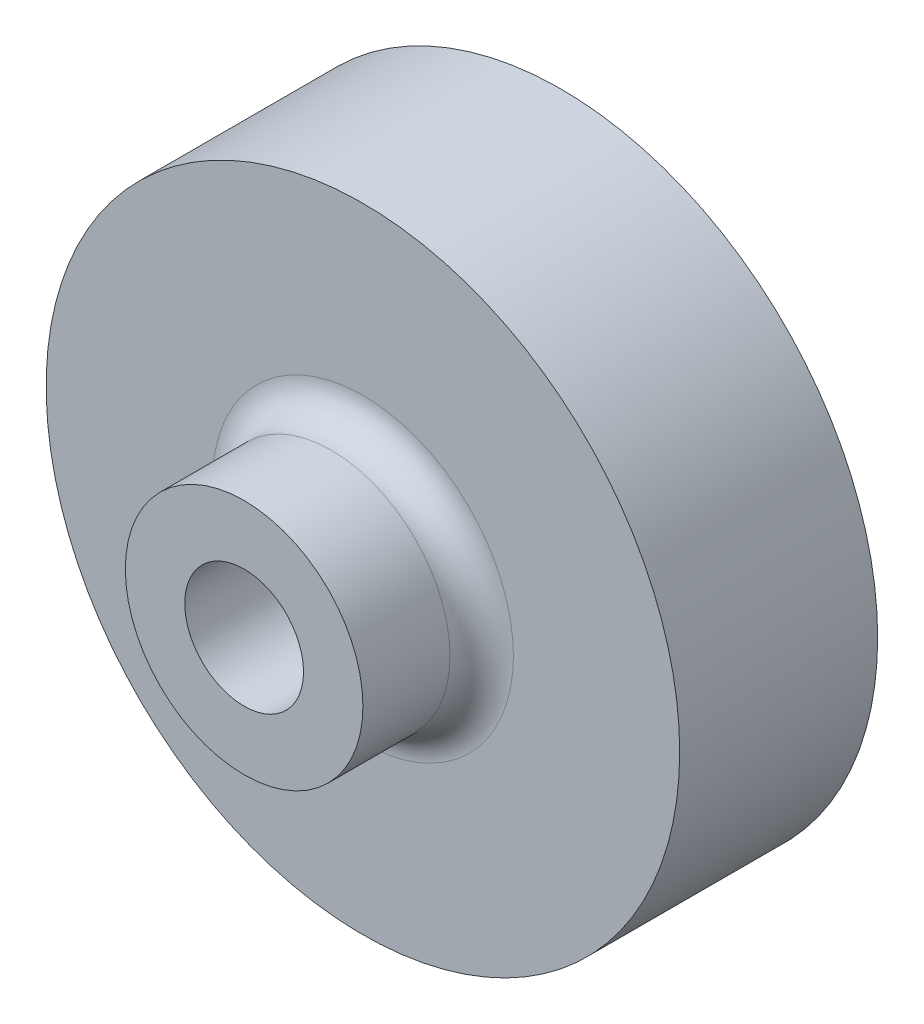
ISO-10303-21;
HEADER;
FILE_DESCRIPTION(('STEP AP214'),'2;1');
FILE_NAME('part.step','',(''),(''),'','','');
FILE_SCHEMA(('AUTOMOTIVE_DESIGN { 1 0 10303 214 1 1 1 1 }'));
ENDSEC;
DATA;
#1=APPLICATION_CONTEXT('core data for automotive mechanical design processes');
#2=APPLICATION_PROTOCOL_DEFINITION('international standard','automotive_design',2000,#1);
#3=PRODUCT_CONTEXT('',#1,'mechanical');
#4=PRODUCT('Part','Part','',(#3));
#5=PRODUCT_RELATED_PRODUCT_CATEGORY('part','',(#4));
#6=PRODUCT_DEFINITION_FORMATION('','',#4);
#7=PRODUCT_DEFINITION_CONTEXT('part definition',#1,'design');
#8=PRODUCT_DEFINITION('design','',#6,#7);
#9=PRODUCT_DEFINITION_SHAPE('','',#8);
#10=(LENGTH_UNIT() NAMED_UNIT(*) SI_UNIT(.MILLI.,.METRE.));
#11=(NAMED_UNIT(*) PLANE_ANGLE_UNIT() SI_UNIT($,.RADIAN.));
#12=(NAMED_UNIT(*) SI_UNIT($,.STERADIAN.) SOLID_ANGLE_UNIT());
#13=UNCERTAINTY_MEASURE_WITH_UNIT(LENGTH_MEASURE(1.E-05),#10,'distance_accuracy_value','');
#14=(GEOMETRIC_REPRESENTATION_CONTEXT(3) GLOBAL_UNCERTAINTY_ASSIGNED_CONTEXT((#13)) GLOBAL_UNIT_ASSIGNED_CONTEXT((#10,
#11,#12)) REPRESENTATION_CONTEXT('',''));
#15=CARTESIAN_POINT('',(0.,0.,0.));
#16=DIRECTION('',(0.,0.,1.));
#17=DIRECTION('',(1.,0.,0.));
#18=AXIS2_PLACEMENT_3D('',#15,#16,#17);
#19=CARTESIAN_POINT('',(0.,0.,0.));
#20=DIRECTION('',(0.,0.,1.));
#21=DIRECTION('',(1.,0.,0.));
#22=AXIS2_PLACEMENT_3D('',#19,#20,#21);
#23=PLANE('',#22);
#24=CARTESIAN_POINT('',(0.,0.,0.));
#25=DIRECTION('',(0.,0.,1.));
#26=DIRECTION('',(1.,0.,0.));
#27=AXIS2_PLACEMENT_3D('',#24,#25,#26);
#28=CIRCLE('',#27,1.875);
#29=CARTESIAN_POINT('',(1.875,0.,0.));
#30=VERTEX_POINT('',#29);
#31=EDGE_CURVE('E232',#30,#30,#28,.T.);
#32=ORIENTED_EDGE('',*,*,#31,.F.);
#33=EDGE_LOOP('',(#32));
#34=FACE_BOUND('',#33,.T.);
#35=CARTESIAN_POINT('',(0.,0.,0.));
#36=DIRECTION('',(0.,0.,1.));
#37=DIRECTION('',(1.,0.,0.));
#38=AXIS2_PLACEMENT_3D('',#35,#36,#37);
#39=CIRCLE('',#38,3.75);
#40=CARTESIAN_POINT('',(3.75,0.,0.));
#41=VERTEX_POINT('',#40);
#42=EDGE_CURVE('E110',#41,#41,#39,.T.);
#43=ORIENTED_EDGE('',*,*,#42,.T.);
#44=EDGE_LOOP('',(#43));
#45=FACE_BOUND('',#44,.T.);
#46=ADVANCED_FACE('F35',(#34,#45),#23,.T.);
#47=CARTESIAN_POINT('',(0.,0.,-3.75));
#48=DIRECTION('',(0.,0.,1.));
#49=DIRECTION('',(1.,0.,0.));
#50=AXIS2_PLACEMENT_3D('',#47,#48,#49);
#51=CYLINDRICAL_SURFACE('',#50,3.75);
#52=CARTESIAN_POINT('',(0.,0.,-2.75));
#53=DIRECTION('',(0.,0.,1.));
#54=DIRECTION('',(1.,0.,0.));
#55=AXIS2_PLACEMENT_3D('',#52,#53,#54);
#56=CIRCLE('',#55,3.75);
#57=CARTESIAN_POINT('',(3.75,0.,-2.75));
#58=VERTEX_POINT('',#57);
#59=EDGE_CURVE('E43',#58,#58,#56,.T.);
#60=ORIENTED_EDGE('',*,*,#59,.T.);
#61=EDGE_LOOP('',(#60));
#62=FACE_BOUND('',#61,.T.);
#63=ORIENTED_EDGE('',*,*,#42,.F.);
#64=EDGE_LOOP('',(#63));
#65=FACE_BOUND('',#64,.T.);
#66=ADVANCED_FACE('F115',(#62,#65),#51,.T.);
#67=CARTESIAN_POINT('',(0.,0.,-3.75));
#68=DIRECTION('',(0.,0.,1.));
#69=DIRECTION('',(1.,0.,0.));
#70=AXIS2_PLACEMENT_3D('',#67,#68,#69);
#71=PLANE('',#70);
#72=CARTESIAN_POINT('',(0.,0.,-3.75));
#73=DIRECTION('',(0.,0.,1.));
#74=DIRECTION('',(1.,0.,0.));
#75=AXIS2_PLACEMENT_3D('',#72,#73,#74);
#76=CIRCLE('',#75,4.75);
#77=CARTESIAN_POINT('',(4.75,0.,-3.75));
#78=VERTEX_POINT('',#77);
#79=EDGE_CURVE('E11',#78,#78,#76,.F.);
#80=ORIENTED_EDGE('',*,*,#79,.T.);
#81=EDGE_LOOP('',(#80));
#82=FACE_BOUND('',#81,.T.);
#83=CARTESIAN_POINT('',(0.,0.,-3.75));
#84=DIRECTION('',(0.,0.,1.));
#85=DIRECTION('',(1.,0.,0.));
#86=AXIS2_PLACEMENT_3D('',#83,#84,#85);
#87=CIRCLE('',#86,10.);
#88=CARTESIAN_POINT('',(10.,0.,-3.75));
#89=VERTEX_POINT('',#88);
#90=EDGE_CURVE('E106',#89,#89,#87,.T.);
#91=ORIENTED_EDGE('',*,*,#90,.T.);
#92=EDGE_LOOP('',(#91));
#93=FACE_BOUND('',#92,.T.);
#94=ADVANCED_FACE('F137',(#82,#93),#71,.T.);
#95=CARTESIAN_POINT('',(0.,0.,-3.75));
#96=DIRECTION('',(0.,0.,1.));
#97=DIRECTION('',(1.,0.,0.));
#98=AXIS2_PLACEMENT_3D('',#95,#96,#97);
#99=CYLINDRICAL_SURFACE('',#98,10.);
#100=CARTESIAN_POINT('',(0.,0.,-10.));
#101=DIRECTION('',(0.,0.,1.));
#102=DIRECTION('',(1.,0.,0.));
#103=AXIS2_PLACEMENT_3D('',#100,#101,#102);
#104=CIRCLE('',#103,10.);
#105=CARTESIAN_POINT('',(10.,0.,-10.));
#106=VERTEX_POINT('',#105);
#107=EDGE_CURVE('E103',#106,#106,#104,.T.);
#108=ORIENTED_EDGE('',*,*,#107,.T.);
#109=EDGE_LOOP('',(#108));
#110=FACE_BOUND('',#109,.T.);
#111=ORIENTED_EDGE('',*,*,#90,.F.);
#112=EDGE_LOOP('',(#111));
#113=FACE_BOUND('',#112,.T.);
#114=ADVANCED_FACE('F144',(#110,#113),#99,.T.);
#115=CARTESIAN_POINT('',(0.,0.,-10.));
#116=DIRECTION('',(0.,0.,1.));
#117=DIRECTION('',(1.,0.,0.));
#118=AXIS2_PLACEMENT_3D('',#115,#116,#117);
#119=PLANE('',#118);
#120=DIRECTION('',(0.,-1.,0.));
#121=VECTOR('',#120,1.);
#122=CARTESIAN_POINT('',(-0.5,1.80710403685012,-10.));
#123=LINE('',#122,#121);
#124=CARTESIAN_POINT('',(-0.5,1.80710403685012,-10.));
#125=VERTEX_POINT('',#124);
#126=CARTESIAN_POINT('',(-0.5,-1.80710403685012,-10.));
#127=VERTEX_POINT('',#126);
#128=EDGE_CURVE('E97',#125,#127,#123,.T.);
#129=ORIENTED_EDGE('',*,*,#128,.F.);
#130=CARTESIAN_POINT('',(0.,0.,-10.));
#131=DIRECTION('',(0.,0.,-1.));
#132=DIRECTION('',(1.,0.,0.));
#133=AXIS2_PLACEMENT_3D('',#130,#131,#132);
#134=CIRCLE('',#133,1.875);
#135=EDGE_CURVE('E50',#127,#125,#134,.T.);
#136=ORIENTED_EDGE('',*,*,#135,.F.);
#137=EDGE_LOOP('',(#129,#136));
#138=FACE_BOUND('',#137,.T.);
#139=DIRECTION('',(0.,1.,0.));
#140=VECTOR('',#139,1.);
#141=CARTESIAN_POINT('',(0.5,1.80710403685012,-10.));
#142=LINE('',#141,#140);
#143=CARTESIAN_POINT('',(0.5,-1.80710403685012,-10.));
#144=VERTEX_POINT('',#143);
#145=CARTESIAN_POINT('',(0.5,1.80710403685012,-10.));
#146=VERTEX_POINT('',#145);
#147=EDGE_CURVE('E85',#144,#146,#142,.T.);
#148=ORIENTED_EDGE('',*,*,#147,.F.);
#149=CARTESIAN_POINT('',(0.,0.,-10.));
#150=DIRECTION('',(0.,0.,-1.));
#151=DIRECTION('',(-1.,0.,0.));
#152=AXIS2_PLACEMENT_3D('',#149,#150,#151);
#153=CIRCLE('',#152,1.875);
#154=EDGE_CURVE('E57',#146,#144,#153,.T.);
#155=ORIENTED_EDGE('',*,*,#154,.F.);
#156=EDGE_LOOP('',(#148,#155));
#157=FACE_BOUND('',#156,.T.);
#158=ORIENTED_EDGE('',*,*,#107,.F.);
#159=EDGE_LOOP('',(#158));
#160=FACE_BOUND('',#159,.T.);
#161=ADVANCED_FACE('F148',(#138,#157,#160),#119,.F.);
#162=CARTESIAN_POINT('',(0.5,1.80710403685012,-8.75));
#163=DIRECTION('',(-1.,0.,0.));
#164=DIRECTION('',(0.,0.,1.));
#165=AXIS2_PLACEMENT_3D('',#162,#163,#164);
#166=PLANE('',#165);
#167=ORIENTED_EDGE('',*,*,#147,.T.);
#168=DIRECTION('',(0.,0.,-1.));
#169=VECTOR('',#168,1.);
#170=CARTESIAN_POINT('',(0.5,1.80710403685012,-8.75));
#171=LINE('',#170,#169);
#172=CARTESIAN_POINT('',(0.5,1.80710403685012,-8.75));
#173=VERTEX_POINT('',#172);
#174=EDGE_CURVE('E89',#173,#146,#171,.T.);
#175=ORIENTED_EDGE('',*,*,#174,.F.);
#176=DIRECTION('',(0.,1.,0.));
#177=VECTOR('',#176,1.);
#178=CARTESIAN_POINT('',(0.5,1.80710403685012,-8.75));
#179=LINE('',#178,#177);
#180=CARTESIAN_POINT('',(0.5,-1.80710403685012,-8.75));
#181=VERTEX_POINT('',#180);
#182=EDGE_CURVE('E76',#181,#173,#179,.T.);
#183=ORIENTED_EDGE('',*,*,#182,.F.);
#184=DIRECTION('',(0.,0.,-1.));
#185=VECTOR('',#184,1.);
#186=CARTESIAN_POINT('',(0.5,-1.80710403685012,-8.75));
#187=LINE('',#186,#185);
#188=EDGE_CURVE('E84',#181,#144,#187,.T.);
#189=ORIENTED_EDGE('',*,*,#188,.T.);
#190=EDGE_LOOP('',(#167,#175,#183,#189));
#191=FACE_BOUND('',#190,.T.);
#192=ADVANCED_FACE('F94',(#191),#166,.F.);
#193=CARTESIAN_POINT('',(0.,0.,-8.75));
#194=DIRECTION('',(0.,0.,-1.));
#195=DIRECTION('',(-1.,0.,0.));
#196=AXIS2_PLACEMENT_3D('',#193,#194,#195);
#197=CYLINDRICAL_SURFACE('',#196,1.875);
#198=ORIENTED_EDGE('',*,*,#135,.T.);
#199=DIRECTION('',(0.,0.,-1.));
#200=VECTOR('',#199,1.);
#201=CARTESIAN_POINT('',(-0.5,1.80710403685012,-8.75));
#202=LINE('',#201,#200);
#203=CARTESIAN_POINT('',(-0.5,1.80710403685012,-8.75));
#204=VERTEX_POINT('',#203);
#205=EDGE_CURVE('E91',#204,#125,#202,.T.);
#206=ORIENTED_EDGE('',*,*,#205,.F.);
#207=CARTESIAN_POINT('',(0.,0.,-8.75));
#208=DIRECTION('',(0.,0.,1.));
#209=DIRECTION('',(1.,0.,0.));
#210=AXIS2_PLACEMENT_3D('',#207,#208,#209);
#211=CIRCLE('',#210,1.875);
#212=EDGE_CURVE('E79',#173,#204,#211,.T.);
#213=ORIENTED_EDGE('',*,*,#212,.F.);
#214=ORIENTED_EDGE('',*,*,#174,.T.);
#215=ORIENTED_EDGE('',*,*,#154,.T.);
#216=ORIENTED_EDGE('',*,*,#188,.F.);
#217=CARTESIAN_POINT('',(-0.5,-1.80710403685012,-8.75));
#218=VERTEX_POINT('',#217);
#219=EDGE_CURVE('E81',#218,#181,#211,.T.);
#220=ORIENTED_EDGE('',*,*,#219,.F.);
#221=DIRECTION('',(0.,0.,-1.));
#222=VECTOR('',#221,1.);
#223=CARTESIAN_POINT('',(-0.5,-1.80710403685012,-8.75));
#224=LINE('',#223,#222);
#225=EDGE_CURVE('E107',#218,#127,#224,.T.);
#226=ORIENTED_EDGE('',*,*,#225,.T.);
#227=EDGE_LOOP('',(#198,#206,#213,#214,#215,#216,#220,#226));
#228=FACE_BOUND('',#227,.T.);
#229=ORIENTED_EDGE('',*,*,#31,.T.);
#230=EDGE_LOOP('',(#229));
#231=FACE_BOUND('',#230,.T.);
#232=ADVANCED_FACE('F87',(#228,#231),#197,.F.);
#233=CARTESIAN_POINT('',(-0.5,1.80710403685012,-8.75));
#234=DIRECTION('',(1.,0.,0.));
#235=DIRECTION('',(0.,0.,-1.));
#236=AXIS2_PLACEMENT_3D('',#233,#234,#235);
#237=PLANE('',#236);
#238=ORIENTED_EDGE('',*,*,#128,.T.);
#239=ORIENTED_EDGE('',*,*,#225,.F.);
#240=DIRECTION('',(0.,-1.,0.));
#241=VECTOR('',#240,1.);
#242=CARTESIAN_POINT('',(-0.5,1.80710403685012,-8.75));
#243=LINE('',#242,#241);
#244=EDGE_CURVE('E228',#204,#218,#243,.T.);
#245=ORIENTED_EDGE('',*,*,#244,.F.);
#246=ORIENTED_EDGE('',*,*,#205,.T.);
#247=EDGE_LOOP('',(#238,#239,#245,#246));
#248=FACE_BOUND('',#247,.T.);
#249=ADVANCED_FACE('F119',(#248),#237,.F.);
#250=CARTESIAN_POINT('',(0.,0.,-2.75));
#251=DIRECTION('',(0.,0.,1.));
#252=DIRECTION('',(1.,0.,0.));
#253=AXIS2_PLACEMENT_3D('',#250,#251,#252);
#254=TOROIDAL_SURFACE('',#253,4.75,1.);
#255=ORIENTED_EDGE('',*,*,#79,.F.);
#256=EDGE_LOOP('',(#255));
#257=FACE_BOUND('',#256,.T.);
#258=ORIENTED_EDGE('',*,*,#59,.F.);
#259=EDGE_LOOP('',(#258));
#260=FACE_BOUND('',#259,.T.);
#261=ADVANCED_FACE('F37',(#257,#260),#254,.F.);
#262=CARTESIAN_POINT('',(0.,0.,-8.75));
#263=DIRECTION('',(0.,0.,1.));
#264=DIRECTION('',(1.,0.,0.));
#265=AXIS2_PLACEMENT_3D('',#262,#263,#264);
#266=PLANE('',#265);
#267=ORIENTED_EDGE('',*,*,#182,.T.);
#268=ORIENTED_EDGE('',*,*,#212,.T.);
#269=ORIENTED_EDGE('',*,*,#244,.T.);
#270=ORIENTED_EDGE('',*,*,#219,.T.);
#271=EDGE_LOOP('',(#267,#268,#269,#270));
#272=FACE_BOUND('',#271,.T.);
#273=ADVANCED_FACE('F78',(#272),#266,.T.);
#274=CLOSED_SHELL('',(#46,#66,#94,#114,#161,#192,#232,#249,#261,#273));
#275=MANIFOLD_SOLID_BREP('B2',#274);
#276=ADVANCED_BREP_SHAPE_REPRESENTATION('',(#18,#275),#14);
#277=SHAPE_DEFINITION_REPRESENTATION(#9,#276);
ENDSEC;
END-ISO-10303-21;
